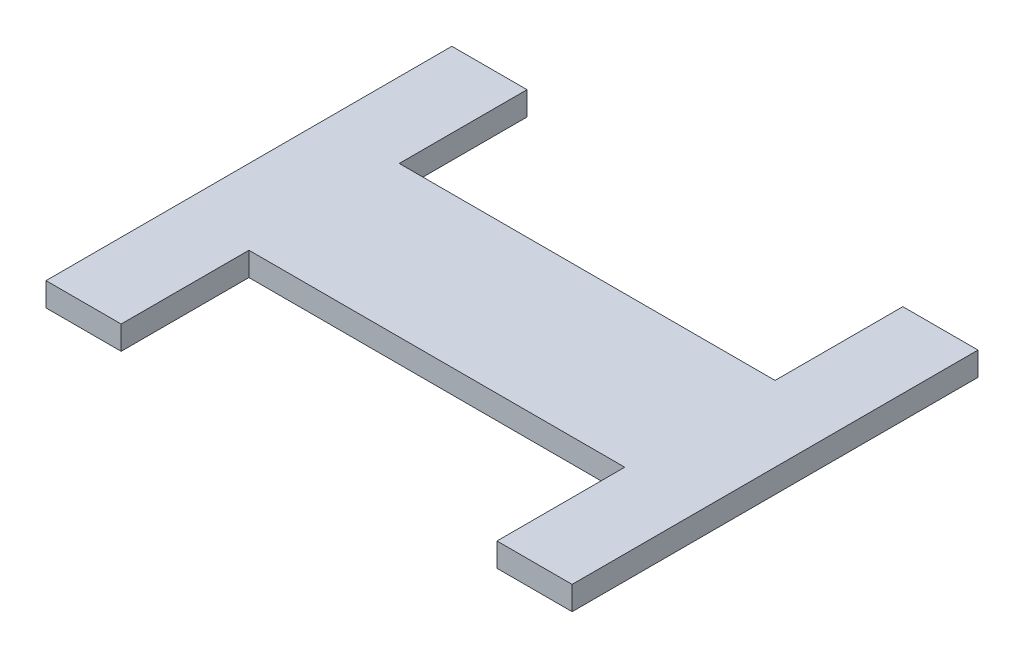
ISO-10303-21;
HEADER;
FILE_DESCRIPTION(('STEP AP214'),'2;1');
FILE_NAME('part.step','',(''),(''),'','','');
FILE_SCHEMA(('AUTOMOTIVE_DESIGN { 1 0 10303 214 1 1 1 1 }'));
ENDSEC;
DATA;
#1=APPLICATION_CONTEXT('core data for automotive mechanical design processes');
#2=APPLICATION_PROTOCOL_DEFINITION('international standard','automotive_design',2000,#1);
#3=PRODUCT_CONTEXT('',#1,'mechanical');
#4=PRODUCT('Part','Part','',(#3));
#5=PRODUCT_RELATED_PRODUCT_CATEGORY('part','',(#4));
#6=PRODUCT_DEFINITION_FORMATION('','',#4);
#7=PRODUCT_DEFINITION_CONTEXT('part definition',#1,'design');
#8=PRODUCT_DEFINITION('design','',#6,#7);
#9=PRODUCT_DEFINITION_SHAPE('','',#8);
#10=(LENGTH_UNIT() NAMED_UNIT(*) SI_UNIT(.MILLI.,.METRE.));
#11=(NAMED_UNIT(*) PLANE_ANGLE_UNIT() SI_UNIT($,.RADIAN.));
#12=(NAMED_UNIT(*) SI_UNIT($,.STERADIAN.) SOLID_ANGLE_UNIT());
#13=UNCERTAINTY_MEASURE_WITH_UNIT(LENGTH_MEASURE(1.E-05),#10,'distance_accuracy_value','');
#14=(GEOMETRIC_REPRESENTATION_CONTEXT(3) GLOBAL_UNCERTAINTY_ASSIGNED_CONTEXT((#13)) GLOBAL_UNIT_ASSIGNED_CONTEXT((#10,
#11,#12)) REPRESENTATION_CONTEXT('',''));
#15=CARTESIAN_POINT('',(0.,0.,0.));
#16=DIRECTION('',(0.,0.,1.));
#17=DIRECTION('',(1.,0.,0.));
#18=AXIS2_PLACEMENT_3D('',#15,#16,#17);
#19=CARTESIAN_POINT('',(0.,4.,12.7));
#20=DIRECTION('',(0.,0.,1.));
#21=DIRECTION('',(1.,0.,0.));
#22=AXIS2_PLACEMENT_3D('',#19,#20,#21);
#23=PLANE('',#22);
#24=DIRECTION('',(-1.,0.,0.));
#25=VECTOR('',#24,1.);
#26=CARTESIAN_POINT('',(0.,0.,12.7));
#27=LINE('',#26,#25);
#28=CARTESIAN_POINT('',(31.75,0.,12.7));
#29=VERTEX_POINT('',#28);
#30=CARTESIAN_POINT('',(-31.75,0.,12.7));
#31=VERTEX_POINT('',#30);
#32=EDGE_CURVE('E145',#29,#31,#27,.T.);
#33=ORIENTED_EDGE('',*,*,#32,.F.);
#34=DIRECTION('',(0.,-1.,0.));
#35=VECTOR('',#34,1.);
#36=CARTESIAN_POINT('',(31.75,4.,12.7));
#37=LINE('',#36,#35);
#38=CARTESIAN_POINT('',(31.75,4.,12.7));
#39=VERTEX_POINT('',#38);
#40=EDGE_CURVE('E131',#39,#29,#37,.T.);
#41=ORIENTED_EDGE('',*,*,#40,.F.);
#42=DIRECTION('',(-1.,0.,0.));
#43=VECTOR('',#42,1.);
#44=CARTESIAN_POINT('',(0.,4.,12.7));
#45=LINE('',#44,#43);
#46=CARTESIAN_POINT('',(-31.75,4.,12.7));
#47=VERTEX_POINT('',#46);
#48=EDGE_CURVE('E143',#39,#47,#45,.T.);
#49=ORIENTED_EDGE('',*,*,#48,.T.);
#50=DIRECTION('',(0.,-1.,0.));
#51=VECTOR('',#50,1.);
#52=CARTESIAN_POINT('',(-31.75,4.,12.7));
#53=LINE('',#52,#51);
#54=EDGE_CURVE('E243',#47,#31,#53,.T.);
#55=ORIENTED_EDGE('',*,*,#54,.T.);
#56=EDGE_LOOP('',(#33,#41,#49,#55));
#57=FACE_BOUND('',#56,.T.);
#58=ADVANCED_FACE('F38',(#57),#23,.T.);
#59=CARTESIAN_POINT('',(-44.45,4.,0.));
#60=DIRECTION('',(-1.,0.,0.));
#61=DIRECTION('',(0.,0.,1.));
#62=AXIS2_PLACEMENT_3D('',#59,#60,#61);
#63=PLANE('',#62);
#64=DIRECTION('',(0.,-1.,0.));
#65=VECTOR('',#64,1.);
#66=CARTESIAN_POINT('',(-44.45,4.,-34.29));
#67=LINE('',#66,#65);
#68=CARTESIAN_POINT('',(-44.45,4.,-34.29));
#69=VERTEX_POINT('',#68);
#70=CARTESIAN_POINT('',(-44.45,0.,-34.29));
#71=VERTEX_POINT('',#70);
#72=EDGE_CURVE('E167',#69,#71,#67,.T.);
#73=ORIENTED_EDGE('',*,*,#72,.T.);
#74=DIRECTION('',(0.,0.,-1.));
#75=VECTOR('',#74,1.);
#76=CARTESIAN_POINT('',(-44.45,0.,0.));
#77=LINE('',#76,#75);
#78=CARTESIAN_POINT('',(-44.45,0.,34.29));
#79=VERTEX_POINT('',#78);
#80=EDGE_CURVE('E168',#79,#71,#77,.T.);
#81=ORIENTED_EDGE('',*,*,#80,.F.);
#82=DIRECTION('',(0.,-1.,0.));
#83=VECTOR('',#82,1.);
#84=CARTESIAN_POINT('',(-44.45,4.,34.29));
#85=LINE('',#84,#83);
#86=CARTESIAN_POINT('',(-44.45,4.,34.29));
#87=VERTEX_POINT('',#86);
#88=EDGE_CURVE('E215',#87,#79,#85,.T.);
#89=ORIENTED_EDGE('',*,*,#88,.F.);
#90=DIRECTION('',(0.,0.,-1.));
#91=VECTOR('',#90,1.);
#92=CARTESIAN_POINT('',(-44.45,4.,0.));
#93=LINE('',#92,#91);
#94=EDGE_CURVE('E154',#87,#69,#93,.T.);
#95=ORIENTED_EDGE('',*,*,#94,.T.);
#96=EDGE_LOOP('',(#73,#81,#89,#95));
#97=FACE_BOUND('',#96,.T.);
#98=ADVANCED_FACE('F40',(#97),#63,.T.);
#99=CARTESIAN_POINT('',(44.45,4.,0.));
#100=DIRECTION('',(-1.,0.,0.));
#101=DIRECTION('',(0.,0.,1.));
#102=AXIS2_PLACEMENT_3D('',#99,#100,#101);
#103=PLANE('',#102);
#104=DIRECTION('',(0.,-1.,0.));
#105=VECTOR('',#104,1.);
#106=CARTESIAN_POINT('',(44.45,4.,-34.29));
#107=LINE('',#106,#105);
#108=CARTESIAN_POINT('',(44.45,4.,-34.29));
#109=VERTEX_POINT('',#108);
#110=CARTESIAN_POINT('',(44.45,0.,-34.29));
#111=VERTEX_POINT('',#110);
#112=EDGE_CURVE('E170',#109,#111,#107,.T.);
#113=ORIENTED_EDGE('',*,*,#112,.F.);
#114=DIRECTION('',(0.,0.,-1.));
#115=VECTOR('',#114,1.);
#116=CARTESIAN_POINT('',(44.45,4.,0.));
#117=LINE('',#116,#115);
#118=CARTESIAN_POINT('',(44.45,4.,34.29));
#119=VERTEX_POINT('',#118);
#120=EDGE_CURVE('E153',#119,#109,#117,.T.);
#121=ORIENTED_EDGE('',*,*,#120,.F.);
#122=DIRECTION('',(0.,-1.,0.));
#123=VECTOR('',#122,1.);
#124=CARTESIAN_POINT('',(44.45,4.,34.29));
#125=LINE('',#124,#123);
#126=CARTESIAN_POINT('',(44.45,0.,34.29));
#127=VERTEX_POINT('',#126);
#128=EDGE_CURVE('E230',#119,#127,#125,.T.);
#129=ORIENTED_EDGE('',*,*,#128,.T.);
#130=DIRECTION('',(0.,0.,-1.));
#131=VECTOR('',#130,1.);
#132=CARTESIAN_POINT('',(44.45,0.,0.));
#133=LINE('',#132,#131);
#134=EDGE_CURVE('E172',#127,#111,#133,.T.);
#135=ORIENTED_EDGE('',*,*,#134,.T.);
#136=EDGE_LOOP('',(#113,#121,#129,#135));
#137=FACE_BOUND('',#136,.T.);
#138=ADVANCED_FACE('F227',(#137),#103,.F.);
#139=CARTESIAN_POINT('',(0.,4.,-12.7));
#140=DIRECTION('',(0.,0.,1.));
#141=DIRECTION('',(1.,0.,0.));
#142=AXIS2_PLACEMENT_3D('',#139,#140,#141);
#143=PLANE('',#142);
#144=DIRECTION('',(-1.,0.,0.));
#145=VECTOR('',#144,1.);
#146=CARTESIAN_POINT('',(0.,4.,-12.7));
#147=LINE('',#146,#145);
#148=CARTESIAN_POINT('',(31.75,4.,-12.7));
#149=VERTEX_POINT('',#148);
#150=CARTESIAN_POINT('',(-31.75,4.,-12.7));
#151=VERTEX_POINT('',#150);
#152=EDGE_CURVE('E61',#149,#151,#147,.T.);
#153=ORIENTED_EDGE('',*,*,#152,.F.);
#154=DIRECTION('',(0.,-1.,0.));
#155=VECTOR('',#154,1.);
#156=CARTESIAN_POINT('',(31.75,4.,-12.7));
#157=LINE('',#156,#155);
#158=CARTESIAN_POINT('',(31.75,0.,-12.7));
#159=VERTEX_POINT('',#158);
#160=EDGE_CURVE('E203',#149,#159,#157,.T.);
#161=ORIENTED_EDGE('',*,*,#160,.T.);
#162=DIRECTION('',(-1.,0.,0.));
#163=VECTOR('',#162,1.);
#164=CARTESIAN_POINT('',(0.,0.,-12.7));
#165=LINE('',#164,#163);
#166=CARTESIAN_POINT('',(-31.75,0.,-12.7));
#167=VERTEX_POINT('',#166);
#168=EDGE_CURVE('E174',#159,#167,#165,.T.);
#169=ORIENTED_EDGE('',*,*,#168,.T.);
#170=DIRECTION('',(0.,-1.,0.));
#171=VECTOR('',#170,1.);
#172=CARTESIAN_POINT('',(-31.75,4.,-12.7));
#173=LINE('',#172,#171);
#174=EDGE_CURVE('E11',#151,#167,#173,.T.);
#175=ORIENTED_EDGE('',*,*,#174,.F.);
#176=EDGE_LOOP('',(#153,#161,#169,#175));
#177=FACE_BOUND('',#176,.T.);
#178=ADVANCED_FACE('F202',(#177),#143,.F.);
#179=CARTESIAN_POINT('',(-31.75,4.,0.));
#180=DIRECTION('',(-1.,0.,0.));
#181=DIRECTION('',(0.,0.,1.));
#182=AXIS2_PLACEMENT_3D('',#179,#180,#181);
#183=PLANE('',#182);
#184=DIRECTION('',(0.,0.,-1.));
#185=VECTOR('',#184,1.);
#186=CARTESIAN_POINT('',(-31.75,0.,0.));
#187=LINE('',#186,#185);
#188=CARTESIAN_POINT('',(-31.75,0.,-34.29));
#189=VERTEX_POINT('',#188);
#190=EDGE_CURVE('E176',#167,#189,#187,.T.);
#191=ORIENTED_EDGE('',*,*,#190,.T.);
#192=DIRECTION('',(0.,-1.,0.));
#193=VECTOR('',#192,1.);
#194=CARTESIAN_POINT('',(-31.75,4.,-34.29));
#195=LINE('',#194,#193);
#196=CARTESIAN_POINT('',(-31.75,4.,-34.29));
#197=VERTEX_POINT('',#196);
#198=EDGE_CURVE('E46',#197,#189,#195,.T.);
#199=ORIENTED_EDGE('',*,*,#198,.F.);
#200=DIRECTION('',(0.,0.,-1.));
#201=VECTOR('',#200,1.);
#202=CARTESIAN_POINT('',(-31.75,4.,0.));
#203=LINE('',#202,#201);
#204=EDGE_CURVE('E162',#151,#197,#203,.T.);
#205=ORIENTED_EDGE('',*,*,#204,.F.);
#206=ORIENTED_EDGE('',*,*,#174,.T.);
#207=EDGE_LOOP('',(#191,#199,#205,#206));
#208=FACE_BOUND('',#207,.T.);
#209=ADVANCED_FACE('F190',(#208),#183,.F.);
#210=CARTESIAN_POINT('',(0.,4.,-34.29));
#211=DIRECTION('',(0.,0.,-1.));
#212=DIRECTION('',(-1.,0.,0.));
#213=AXIS2_PLACEMENT_3D('',#210,#211,#212);
#214=PLANE('',#213);
#215=DIRECTION('',(1.,0.,0.));
#216=VECTOR('',#215,1.);
#217=CARTESIAN_POINT('',(0.,0.,-34.29));
#218=LINE('',#217,#216);
#219=EDGE_CURVE('E157',#71,#189,#218,.T.);
#220=ORIENTED_EDGE('',*,*,#219,.F.);
#221=ORIENTED_EDGE('',*,*,#72,.F.);
#222=DIRECTION('',(1.,0.,0.));
#223=VECTOR('',#222,1.);
#224=CARTESIAN_POINT('',(0.,4.,-34.29));
#225=LINE('',#224,#223);
#226=EDGE_CURVE('E164',#69,#197,#225,.T.);
#227=ORIENTED_EDGE('',*,*,#226,.T.);
#228=ORIENTED_EDGE('',*,*,#198,.T.);
#229=EDGE_LOOP('',(#220,#221,#227,#228));
#230=FACE_BOUND('',#229,.T.);
#231=ADVANCED_FACE('F185',(#230),#214,.T.);
#232=CARTESIAN_POINT('',(0.,4.,0.));
#233=DIRECTION('',(0.,1.,0.));
#234=DIRECTION('',(0.,0.,1.));
#235=AXIS2_PLACEMENT_3D('',#232,#233,#234);
#236=PLANE('',#235);
#237=ORIENTED_EDGE('',*,*,#226,.F.);
#238=ORIENTED_EDGE('',*,*,#94,.F.);
#239=DIRECTION('',(1.,0.,0.));
#240=VECTOR('',#239,1.);
#241=CARTESIAN_POINT('',(0.,4.,34.29));
#242=LINE('',#241,#240);
#243=CARTESIAN_POINT('',(-31.75,4.,34.29));
#244=VERTEX_POINT('',#243);
#245=EDGE_CURVE('E239',#87,#244,#242,.T.);
#246=ORIENTED_EDGE('',*,*,#245,.T.);
#247=DIRECTION('',(0.,0.,1.));
#248=VECTOR('',#247,1.);
#249=CARTESIAN_POINT('',(-31.75,4.,0.));
#250=LINE('',#249,#248);
#251=EDGE_CURVE('E152',#47,#244,#250,.T.);
#252=ORIENTED_EDGE('',*,*,#251,.F.);
#253=ORIENTED_EDGE('',*,*,#48,.F.);
#254=DIRECTION('',(0.,0.,1.));
#255=VECTOR('',#254,1.);
#256=CARTESIAN_POINT('',(31.75,4.,0.));
#257=LINE('',#256,#255);
#258=CARTESIAN_POINT('',(31.75,4.,34.29));
#259=VERTEX_POINT('',#258);
#260=EDGE_CURVE('E128',#39,#259,#257,.T.);
#261=ORIENTED_EDGE('',*,*,#260,.T.);
#262=DIRECTION('',(-1.,0.,0.));
#263=VECTOR('',#262,1.);
#264=CARTESIAN_POINT('',(0.,4.,34.29));
#265=LINE('',#264,#263);
#266=EDGE_CURVE('E138',#119,#259,#265,.T.);
#267=ORIENTED_EDGE('',*,*,#266,.F.);
#268=ORIENTED_EDGE('',*,*,#120,.T.);
#269=DIRECTION('',(-1.,0.,0.));
#270=VECTOR('',#269,1.);
#271=CARTESIAN_POINT('',(0.,4.,-34.29));
#272=LINE('',#271,#270);
#273=CARTESIAN_POINT('',(31.75,4.,-34.29));
#274=VERTEX_POINT('',#273);
#275=EDGE_CURVE('E212',#109,#274,#272,.T.);
#276=ORIENTED_EDGE('',*,*,#275,.T.);
#277=DIRECTION('',(0.,0.,-1.));
#278=VECTOR('',#277,1.);
#279=CARTESIAN_POINT('',(31.75,4.,0.));
#280=LINE('',#279,#278);
#281=EDGE_CURVE('E201',#149,#274,#280,.T.);
#282=ORIENTED_EDGE('',*,*,#281,.F.);
#283=ORIENTED_EDGE('',*,*,#152,.T.);
#284=ORIENTED_EDGE('',*,*,#204,.T.);
#285=EDGE_LOOP('',(#237,#238,#246,#252,#253,#261,#267,#268,#276,#282,#283,#284));
#286=FACE_BOUND('',#285,.T.);
#287=ADVANCED_FACE('F150',(#286),#236,.T.);
#288=CARTESIAN_POINT('',(0.,0.,0.));
#289=DIRECTION('',(0.,1.,0.));
#290=DIRECTION('',(0.,0.,1.));
#291=AXIS2_PLACEMENT_3D('',#288,#289,#290);
#292=PLANE('',#291);
#293=ORIENTED_EDGE('',*,*,#190,.F.);
#294=ORIENTED_EDGE('',*,*,#168,.F.);
#295=DIRECTION('',(0.,0.,-1.));
#296=VECTOR('',#295,1.);
#297=CARTESIAN_POINT('',(31.75,0.,0.));
#298=LINE('',#297,#296);
#299=CARTESIAN_POINT('',(31.75,0.,-34.29));
#300=VERTEX_POINT('',#299);
#301=EDGE_CURVE('E207',#159,#300,#298,.T.);
#302=ORIENTED_EDGE('',*,*,#301,.T.);
#303=DIRECTION('',(-1.,0.,0.));
#304=VECTOR('',#303,1.);
#305=CARTESIAN_POINT('',(0.,0.,-34.29));
#306=LINE('',#305,#304);
#307=EDGE_CURVE('E209',#111,#300,#306,.T.);
#308=ORIENTED_EDGE('',*,*,#307,.F.);
#309=ORIENTED_EDGE('',*,*,#134,.F.);
#310=DIRECTION('',(-1.,0.,0.));
#311=VECTOR('',#310,1.);
#312=CARTESIAN_POINT('',(0.,0.,34.29));
#313=LINE('',#312,#311);
#314=CARTESIAN_POINT('',(31.75,0.,34.29));
#315=VERTEX_POINT('',#314);
#316=EDGE_CURVE('E139',#127,#315,#313,.T.);
#317=ORIENTED_EDGE('',*,*,#316,.T.);
#318=DIRECTION('',(0.,0.,1.));
#319=VECTOR('',#318,1.);
#320=CARTESIAN_POINT('',(31.75,0.,0.));
#321=LINE('',#320,#319);
#322=EDGE_CURVE('E53',#29,#315,#321,.T.);
#323=ORIENTED_EDGE('',*,*,#322,.F.);
#324=ORIENTED_EDGE('',*,*,#32,.T.);
#325=DIRECTION('',(0.,0.,1.));
#326=VECTOR('',#325,1.);
#327=CARTESIAN_POINT('',(-31.75,0.,0.));
#328=LINE('',#327,#326);
#329=CARTESIAN_POINT('',(-31.75,0.,34.29));
#330=VERTEX_POINT('',#329);
#331=EDGE_CURVE('E241',#31,#330,#328,.T.);
#332=ORIENTED_EDGE('',*,*,#331,.T.);
#333=DIRECTION('',(1.,0.,0.));
#334=VECTOR('',#333,1.);
#335=CARTESIAN_POINT('',(0.,0.,34.29));
#336=LINE('',#335,#334);
#337=EDGE_CURVE('E146',#79,#330,#336,.T.);
#338=ORIENTED_EDGE('',*,*,#337,.F.);
#339=ORIENTED_EDGE('',*,*,#80,.T.);
#340=ORIENTED_EDGE('',*,*,#219,.T.);
#341=EDGE_LOOP('',(#293,#294,#302,#308,#309,#317,#323,#324,#332,#338,#339,#340));
#342=FACE_BOUND('',#341,.T.);
#343=ADVANCED_FACE('F191',(#342),#292,.F.);
#344=CARTESIAN_POINT('',(0.,4.,-34.29));
#345=DIRECTION('',(0.,0.,1.));
#346=DIRECTION('',(1.,0.,0.));
#347=AXIS2_PLACEMENT_3D('',#344,#345,#346);
#348=PLANE('',#347);
#349=ORIENTED_EDGE('',*,*,#307,.T.);
#350=DIRECTION('',(0.,-1.,0.));
#351=VECTOR('',#350,1.);
#352=CARTESIAN_POINT('',(31.75,4.,-34.29));
#353=LINE('',#352,#351);
#354=EDGE_CURVE('E220',#274,#300,#353,.T.);
#355=ORIENTED_EDGE('',*,*,#354,.F.);
#356=ORIENTED_EDGE('',*,*,#275,.F.);
#357=ORIENTED_EDGE('',*,*,#112,.T.);
#358=EDGE_LOOP('',(#349,#355,#356,#357));
#359=FACE_BOUND('',#358,.T.);
#360=ADVANCED_FACE('F224',(#359),#348,.F.);
#361=CARTESIAN_POINT('',(31.75,4.,0.));
#362=DIRECTION('',(-1.,0.,0.));
#363=DIRECTION('',(0.,0.,1.));
#364=AXIS2_PLACEMENT_3D('',#361,#362,#363);
#365=PLANE('',#364);
#366=ORIENTED_EDGE('',*,*,#301,.F.);
#367=ORIENTED_EDGE('',*,*,#160,.F.);
#368=ORIENTED_EDGE('',*,*,#281,.T.);
#369=ORIENTED_EDGE('',*,*,#354,.T.);
#370=EDGE_LOOP('',(#366,#367,#368,#369));
#371=FACE_BOUND('',#370,.T.);
#372=ADVANCED_FACE('F249',(#371),#365,.T.);
#373=CARTESIAN_POINT('',(0.,4.,34.29));
#374=DIRECTION('',(0.,0.,-1.));
#375=DIRECTION('',(-1.,0.,0.));
#376=AXIS2_PLACEMENT_3D('',#373,#374,#375);
#377=PLANE('',#376);
#378=ORIENTED_EDGE('',*,*,#337,.T.);
#379=DIRECTION('',(0.,-1.,0.));
#380=VECTOR('',#379,1.);
#381=CARTESIAN_POINT('',(-31.75,4.,34.29));
#382=LINE('',#381,#380);
#383=EDGE_CURVE('E247',#244,#330,#382,.T.);
#384=ORIENTED_EDGE('',*,*,#383,.F.);
#385=ORIENTED_EDGE('',*,*,#245,.F.);
#386=ORIENTED_EDGE('',*,*,#88,.T.);
#387=EDGE_LOOP('',(#378,#384,#385,#386));
#388=FACE_BOUND('',#387,.T.);
#389=ADVANCED_FACE('F251',(#388),#377,.F.);
#390=CARTESIAN_POINT('',(-31.75,4.,0.));
#391=DIRECTION('',(1.,0.,0.));
#392=DIRECTION('',(0.,0.,-1.));
#393=AXIS2_PLACEMENT_3D('',#390,#391,#392);
#394=PLANE('',#393);
#395=ORIENTED_EDGE('',*,*,#331,.F.);
#396=ORIENTED_EDGE('',*,*,#54,.F.);
#397=ORIENTED_EDGE('',*,*,#251,.T.);
#398=ORIENTED_EDGE('',*,*,#383,.T.);
#399=EDGE_LOOP('',(#395,#396,#397,#398));
#400=FACE_BOUND('',#399,.T.);
#401=ADVANCED_FACE('F257',(#400),#394,.T.);
#402=CARTESIAN_POINT('',(31.75,4.,0.));
#403=DIRECTION('',(1.,0.,0.));
#404=DIRECTION('',(0.,0.,-1.));
#405=AXIS2_PLACEMENT_3D('',#402,#403,#404);
#406=PLANE('',#405);
#407=ORIENTED_EDGE('',*,*,#322,.T.);
#408=DIRECTION('',(0.,-1.,0.));
#409=VECTOR('',#408,1.);
#410=CARTESIAN_POINT('',(31.75,4.,34.29));
#411=LINE('',#410,#409);
#412=EDGE_CURVE('E133',#259,#315,#411,.T.);
#413=ORIENTED_EDGE('',*,*,#412,.F.);
#414=ORIENTED_EDGE('',*,*,#260,.F.);
#415=ORIENTED_EDGE('',*,*,#40,.T.);
#416=EDGE_LOOP('',(#407,#413,#414,#415));
#417=FACE_BOUND('',#416,.T.);
#418=ADVANCED_FACE('F130',(#417),#406,.F.);
#419=CARTESIAN_POINT('',(0.,4.,34.29));
#420=DIRECTION('',(0.,0.,1.));
#421=DIRECTION('',(1.,0.,0.));
#422=AXIS2_PLACEMENT_3D('',#419,#420,#421);
#423=PLANE('',#422);
#424=ORIENTED_EDGE('',*,*,#316,.F.);
#425=ORIENTED_EDGE('',*,*,#128,.F.);
#426=ORIENTED_EDGE('',*,*,#266,.T.);
#427=ORIENTED_EDGE('',*,*,#412,.T.);
#428=EDGE_LOOP('',(#424,#425,#426,#427));
#429=FACE_BOUND('',#428,.T.);
#430=ADVANCED_FACE('F420',(#429),#423,.T.);
#431=CLOSED_SHELL('',(#58,#98,#138,#178,#209,#231,#287,#343,#360,#372,#389,#401,#418,#430));
#432=MANIFOLD_SOLID_BREP('B2',#431);
#433=ADVANCED_BREP_SHAPE_REPRESENTATION('',(#18,#432),#14);
#434=SHAPE_DEFINITION_REPRESENTATION(#9,#433);
ENDSEC;
END-ISO-10303-21;
